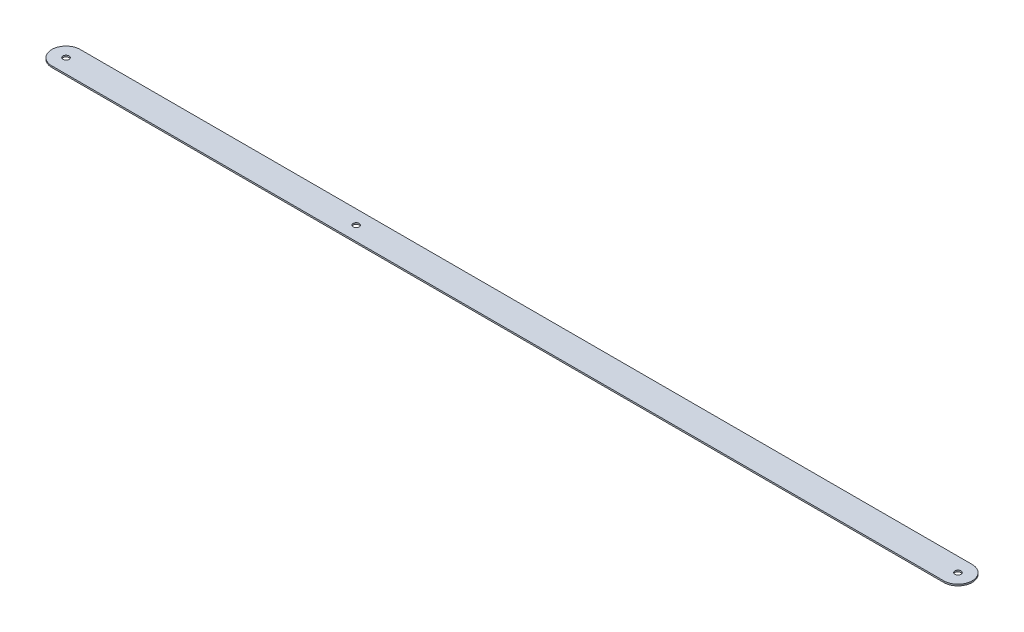
ISO-10303-21;
HEADER;
FILE_DESCRIPTION(('STEP AP214'),'2;1');
FILE_NAME('part.step','',(''),(''),'','','');
FILE_SCHEMA(('AUTOMOTIVE_DESIGN { 1 0 10303 214 1 1 1 1 }'));
ENDSEC;
DATA;
#1=APPLICATION_CONTEXT('core data for automotive mechanical design processes');
#2=APPLICATION_PROTOCOL_DEFINITION('international standard','automotive_design',2000,#1);
#3=PRODUCT_CONTEXT('',#1,'mechanical');
#4=PRODUCT('Part','Part','',(#3));
#5=PRODUCT_RELATED_PRODUCT_CATEGORY('part','',(#4));
#6=PRODUCT_DEFINITION_FORMATION('','',#4);
#7=PRODUCT_DEFINITION_CONTEXT('part definition',#1,'design');
#8=PRODUCT_DEFINITION('design','',#6,#7);
#9=PRODUCT_DEFINITION_SHAPE('','',#8);
#10=(LENGTH_UNIT() NAMED_UNIT(*) SI_UNIT(.MILLI.,.METRE.));
#11=(NAMED_UNIT(*) PLANE_ANGLE_UNIT() SI_UNIT($,.RADIAN.));
#12=(NAMED_UNIT(*) SI_UNIT($,.STERADIAN.) SOLID_ANGLE_UNIT());
#13=UNCERTAINTY_MEASURE_WITH_UNIT(LENGTH_MEASURE(1.E-05),#10,'distance_accuracy_value','');
#14=(GEOMETRIC_REPRESENTATION_CONTEXT(3) GLOBAL_UNCERTAINTY_ASSIGNED_CONTEXT((#13)) GLOBAL_UNIT_ASSIGNED_CONTEXT((#10,
#11,#12)) REPRESENTATION_CONTEXT('',''));
#15=CARTESIAN_POINT('',(0.,0.,0.));
#16=DIRECTION('',(0.,0.,1.));
#17=DIRECTION('',(1.,0.,0.));
#18=AXIS2_PLACEMENT_3D('',#15,#16,#17);
#19=CARTESIAN_POINT('',(0.,1.5,0.));
#20=DIRECTION('',(0.,1.,0.));
#21=DIRECTION('',(0.,0.,1.));
#22=AXIS2_PLACEMENT_3D('',#19,#20,#21);
#23=PLANE('',#22);
#24=CARTESIAN_POINT('',(0.,1.5,0.));
#25=DIRECTION('',(0.,1.,0.));
#26=DIRECTION('',(0.,0.,1.));
#27=AXIS2_PLACEMENT_3D('',#24,#25,#26);
#28=CIRCLE('',#27,3.);
#29=CARTESIAN_POINT('',(0.,1.5,3.));
#30=VERTEX_POINT('',#29);
#31=EDGE_CURVE('E116',#30,#30,#28,.T.);
#32=ORIENTED_EDGE('',*,*,#31,.F.);
#33=EDGE_LOOP('',(#32));
#34=FACE_BOUND('',#33,.T.);
#35=CARTESIAN_POINT('',(0.,1.5,0.));
#36=DIRECTION('',(0.,1.,0.));
#37=DIRECTION('',(0.,0.,1.));
#38=AXIS2_PLACEMENT_3D('',#35,#36,#37);
#39=CIRCLE('',#38,14.);
#40=CARTESIAN_POINT('',(0.,1.5,-14.));
#41=VERTEX_POINT('',#40);
#42=CARTESIAN_POINT('',(0.,1.5,14.));
#43=VERTEX_POINT('',#42);
#44=EDGE_CURVE('E86',#41,#43,#39,.T.);
#45=ORIENTED_EDGE('',*,*,#44,.T.);
#46=DIRECTION('',(1.,0.,0.));
#47=VECTOR('',#46,1.);
#48=CARTESIAN_POINT('',(0.,1.5,14.));
#49=LINE('',#48,#47);
#50=CARTESIAN_POINT('',(880.4,1.5,14.));
#51=VERTEX_POINT('',#50);
#52=EDGE_CURVE('E81',#43,#51,#49,.T.);
#53=ORIENTED_EDGE('',*,*,#52,.T.);
#54=CARTESIAN_POINT('',(880.4,1.5,0.));
#55=DIRECTION('',(0.,1.,0.));
#56=DIRECTION('',(0.,0.,1.));
#57=AXIS2_PLACEMENT_3D('',#54,#55,#56);
#58=CIRCLE('',#57,14.);
#59=CARTESIAN_POINT('',(880.4,1.5,-14.));
#60=VERTEX_POINT('',#59);
#61=EDGE_CURVE('E84',#51,#60,#58,.T.);
#62=ORIENTED_EDGE('',*,*,#61,.T.);
#63=DIRECTION('',(-1.,0.,0.));
#64=VECTOR('',#63,1.);
#65=CARTESIAN_POINT('',(0.,1.5,-14.));
#66=LINE('',#65,#64);
#67=EDGE_CURVE('E51',#60,#41,#66,.T.);
#68=ORIENTED_EDGE('',*,*,#67,.T.);
#69=EDGE_LOOP('',(#45,#53,#62,#68));
#70=FACE_BOUND('',#69,.T.);
#71=CARTESIAN_POINT('',(880.4,1.5,0.));
#72=DIRECTION('',(0.,1.,0.));
#73=DIRECTION('',(0.,0.,1.));
#74=AXIS2_PLACEMENT_3D('',#71,#72,#73);
#75=CIRCLE('',#74,3.00000000000005);
#76=CARTESIAN_POINT('',(880.4,1.5,3.00000000000005));
#77=VERTEX_POINT('',#76);
#78=EDGE_CURVE('E101',#77,#77,#75,.T.);
#79=ORIENTED_EDGE('',*,*,#78,.F.);
#80=EDGE_LOOP('',(#79));
#81=FACE_BOUND('',#80,.T.);
#82=CARTESIAN_POINT('',(286.33,1.5,0.));
#83=DIRECTION('',(0.,1.,0.));
#84=DIRECTION('',(0.,0.,1.));
#85=AXIS2_PLACEMENT_3D('',#82,#83,#84);
#86=CIRCLE('',#85,3.00000000000005);
#87=CARTESIAN_POINT('',(286.33,1.5,3.00000000000005));
#88=VERTEX_POINT('',#87);
#89=EDGE_CURVE('E122',#88,#88,#86,.T.);
#90=ORIENTED_EDGE('',*,*,#89,.F.);
#91=EDGE_LOOP('',(#90));
#92=FACE_BOUND('',#91,.T.);
#93=ADVANCED_FACE('F34',(#34,#70,#81,#92),#23,.T.);
#94=CARTESIAN_POINT('',(0.,0.,0.));
#95=DIRECTION('',(0.,1.,0.));
#96=DIRECTION('',(0.,0.,1.));
#97=AXIS2_PLACEMENT_3D('',#94,#95,#96);
#98=PLANE('',#97);
#99=CARTESIAN_POINT('',(0.,0.,0.));
#100=DIRECTION('',(0.,1.,0.));
#101=DIRECTION('',(0.,0.,1.));
#102=AXIS2_PLACEMENT_3D('',#99,#100,#101);
#103=CIRCLE('',#102,14.);
#104=CARTESIAN_POINT('',(0.,0.,-14.));
#105=VERTEX_POINT('',#104);
#106=CARTESIAN_POINT('',(0.,0.,14.));
#107=VERTEX_POINT('',#106);
#108=EDGE_CURVE('E98',#105,#107,#103,.T.);
#109=ORIENTED_EDGE('',*,*,#108,.F.);
#110=DIRECTION('',(-1.,0.,0.));
#111=VECTOR('',#110,1.);
#112=CARTESIAN_POINT('',(0.,0.,-14.));
#113=LINE('',#112,#111);
#114=CARTESIAN_POINT('',(880.4,0.,-14.));
#115=VERTEX_POINT('',#114);
#116=EDGE_CURVE('E74',#115,#105,#113,.T.);
#117=ORIENTED_EDGE('',*,*,#116,.F.);
#118=CARTESIAN_POINT('',(880.4,0.,0.));
#119=DIRECTION('',(0.,1.,0.));
#120=DIRECTION('',(0.,0.,1.));
#121=AXIS2_PLACEMENT_3D('',#118,#119,#120);
#122=CIRCLE('',#121,14.);
#123=CARTESIAN_POINT('',(880.4,0.,14.));
#124=VERTEX_POINT('',#123);
#125=EDGE_CURVE('E68',#124,#115,#122,.T.);
#126=ORIENTED_EDGE('',*,*,#125,.F.);
#127=DIRECTION('',(1.,0.,0.));
#128=VECTOR('',#127,1.);
#129=CARTESIAN_POINT('',(0.,0.,14.));
#130=LINE('',#129,#128);
#131=EDGE_CURVE('E90',#107,#124,#130,.T.);
#132=ORIENTED_EDGE('',*,*,#131,.F.);
#133=EDGE_LOOP('',(#109,#117,#126,#132));
#134=FACE_BOUND('',#133,.T.);
#135=CARTESIAN_POINT('',(880.4,0.,0.));
#136=DIRECTION('',(0.,1.,0.));
#137=DIRECTION('',(0.,0.,1.));
#138=AXIS2_PLACEMENT_3D('',#135,#136,#137);
#139=CIRCLE('',#138,3.00000000000005);
#140=CARTESIAN_POINT('',(880.4,0.,3.00000000000005));
#141=VERTEX_POINT('',#140);
#142=EDGE_CURVE('E113',#141,#141,#139,.T.);
#143=ORIENTED_EDGE('',*,*,#142,.T.);
#144=EDGE_LOOP('',(#143));
#145=FACE_BOUND('',#144,.T.);
#146=CARTESIAN_POINT('',(0.,0.,0.));
#147=DIRECTION('',(0.,1.,0.));
#148=DIRECTION('',(0.,0.,1.));
#149=AXIS2_PLACEMENT_3D('',#146,#147,#148);
#150=CIRCLE('',#149,3.);
#151=CARTESIAN_POINT('',(0.,0.,3.));
#152=VERTEX_POINT('',#151);
#153=EDGE_CURVE('E119',#152,#152,#150,.T.);
#154=ORIENTED_EDGE('',*,*,#153,.T.);
#155=EDGE_LOOP('',(#154));
#156=FACE_BOUND('',#155,.T.);
#157=CARTESIAN_POINT('',(286.33,0.,0.));
#158=DIRECTION('',(0.,1.,0.));
#159=DIRECTION('',(0.,0.,1.));
#160=AXIS2_PLACEMENT_3D('',#157,#158,#159);
#161=CIRCLE('',#160,3.00000000000005);
#162=CARTESIAN_POINT('',(286.33,0.,3.00000000000005));
#163=VERTEX_POINT('',#162);
#164=EDGE_CURVE('E125',#163,#163,#161,.T.);
#165=ORIENTED_EDGE('',*,*,#164,.T.);
#166=EDGE_LOOP('',(#165));
#167=FACE_BOUND('',#166,.T.);
#168=ADVANCED_FACE('F109',(#134,#145,#156,#167),#98,.F.);
#169=CARTESIAN_POINT('',(0.,1.5,0.));
#170=DIRECTION('',(0.,-1.,0.));
#171=DIRECTION('',(0.,0.,-1.));
#172=AXIS2_PLACEMENT_3D('',#169,#170,#171);
#173=CYLINDRICAL_SURFACE('',#172,14.);
#174=ORIENTED_EDGE('',*,*,#108,.T.);
#175=DIRECTION('',(0.,-1.,0.));
#176=VECTOR('',#175,1.);
#177=CARTESIAN_POINT('',(0.,1.5,14.));
#178=LINE('',#177,#176);
#179=EDGE_CURVE('E11',#43,#107,#178,.T.);
#180=ORIENTED_EDGE('',*,*,#179,.F.);
#181=ORIENTED_EDGE('',*,*,#44,.F.);
#182=DIRECTION('',(0.,-1.,0.));
#183=VECTOR('',#182,1.);
#184=CARTESIAN_POINT('',(0.,1.5,-14.));
#185=LINE('',#184,#183);
#186=EDGE_CURVE('E94',#41,#105,#185,.T.);
#187=ORIENTED_EDGE('',*,*,#186,.T.);
#188=EDGE_LOOP('',(#174,#180,#181,#187));
#189=FACE_BOUND('',#188,.T.);
#190=ADVANCED_FACE('F36',(#189),#173,.T.);
#191=CARTESIAN_POINT('',(0.,1.5,14.));
#192=DIRECTION('',(0.,0.,-1.));
#193=DIRECTION('',(-1.,0.,0.));
#194=AXIS2_PLACEMENT_3D('',#191,#192,#193);
#195=PLANE('',#194);
#196=ORIENTED_EDGE('',*,*,#131,.T.);
#197=DIRECTION('',(0.,-1.,0.));
#198=VECTOR('',#197,1.);
#199=CARTESIAN_POINT('',(880.4,1.5,14.));
#200=LINE('',#199,#198);
#201=EDGE_CURVE('E43',#51,#124,#200,.T.);
#202=ORIENTED_EDGE('',*,*,#201,.F.);
#203=ORIENTED_EDGE('',*,*,#52,.F.);
#204=ORIENTED_EDGE('',*,*,#179,.T.);
#205=EDGE_LOOP('',(#196,#202,#203,#204));
#206=FACE_BOUND('',#205,.T.);
#207=ADVANCED_FACE('F89',(#206),#195,.F.);
#208=CARTESIAN_POINT('',(880.4,1.5,0.));
#209=DIRECTION('',(0.,-1.,0.));
#210=DIRECTION('',(0.,0.,-1.));
#211=AXIS2_PLACEMENT_3D('',#208,#209,#210);
#212=CYLINDRICAL_SURFACE('',#211,14.);
#213=ORIENTED_EDGE('',*,*,#125,.T.);
#214=DIRECTION('',(0.,-1.,0.));
#215=VECTOR('',#214,1.);
#216=CARTESIAN_POINT('',(880.4,1.5,-14.));
#217=LINE('',#216,#215);
#218=EDGE_CURVE('E91',#60,#115,#217,.T.);
#219=ORIENTED_EDGE('',*,*,#218,.F.);
#220=ORIENTED_EDGE('',*,*,#61,.F.);
#221=ORIENTED_EDGE('',*,*,#201,.T.);
#222=EDGE_LOOP('',(#213,#219,#220,#221));
#223=FACE_BOUND('',#222,.T.);
#224=ADVANCED_FACE('F92',(#223),#212,.T.);
#225=CARTESIAN_POINT('',(0.,1.5,-14.));
#226=DIRECTION('',(0.,0.,1.));
#227=DIRECTION('',(1.,0.,0.));
#228=AXIS2_PLACEMENT_3D('',#225,#226,#227);
#229=PLANE('',#228);
#230=ORIENTED_EDGE('',*,*,#116,.T.);
#231=ORIENTED_EDGE('',*,*,#186,.F.);
#232=ORIENTED_EDGE('',*,*,#67,.F.);
#233=ORIENTED_EDGE('',*,*,#218,.T.);
#234=EDGE_LOOP('',(#230,#231,#232,#233));
#235=FACE_BOUND('',#234,.T.);
#236=ADVANCED_FACE('F106',(#235),#229,.F.);
#237=CARTESIAN_POINT('',(880.4,1.5,0.));
#238=DIRECTION('',(0.,-1.,0.));
#239=DIRECTION('',(0.,0.,-1.));
#240=AXIS2_PLACEMENT_3D('',#237,#238,#239);
#241=CYLINDRICAL_SURFACE('',#240,3.00000000000005);
#242=ORIENTED_EDGE('',*,*,#78,.T.);
#243=EDGE_LOOP('',(#242));
#244=FACE_BOUND('',#243,.T.);
#245=ORIENTED_EDGE('',*,*,#142,.F.);
#246=EDGE_LOOP('',(#245));
#247=FACE_BOUND('',#246,.T.);
#248=ADVANCED_FACE('F143',(#244,#247),#241,.F.);
#249=CARTESIAN_POINT('',(0.,1.5,0.));
#250=DIRECTION('',(0.,-1.,0.));
#251=DIRECTION('',(0.,0.,-1.));
#252=AXIS2_PLACEMENT_3D('',#249,#250,#251);
#253=CYLINDRICAL_SURFACE('',#252,3.);
#254=ORIENTED_EDGE('',*,*,#31,.T.);
#255=EDGE_LOOP('',(#254));
#256=FACE_BOUND('',#255,.T.);
#257=ORIENTED_EDGE('',*,*,#153,.F.);
#258=EDGE_LOOP('',(#257));
#259=FACE_BOUND('',#258,.T.);
#260=ADVANCED_FACE('F189',(#256,#259),#253,.F.);
#261=CARTESIAN_POINT('',(286.33,1.5,0.));
#262=DIRECTION('',(0.,-1.,0.));
#263=DIRECTION('',(0.,0.,-1.));
#264=AXIS2_PLACEMENT_3D('',#261,#262,#263);
#265=CYLINDRICAL_SURFACE('',#264,3.00000000000005);
#266=ORIENTED_EDGE('',*,*,#89,.T.);
#267=EDGE_LOOP('',(#266));
#268=FACE_BOUND('',#267,.T.);
#269=ORIENTED_EDGE('',*,*,#164,.F.);
#270=EDGE_LOOP('',(#269));
#271=FACE_BOUND('',#270,.T.);
#272=ADVANCED_FACE('F131',(#268,#271),#265,.F.);
#273=CLOSED_SHELL('',(#93,#168,#190,#207,#224,#236,#248,#260,#272));
#274=MANIFOLD_SOLID_BREP('B2',#273);
#275=ADVANCED_BREP_SHAPE_REPRESENTATION('',(#18,#274),#14);
#276=SHAPE_DEFINITION_REPRESENTATION(#9,#275);
ENDSEC;
END-ISO-10303-21;
